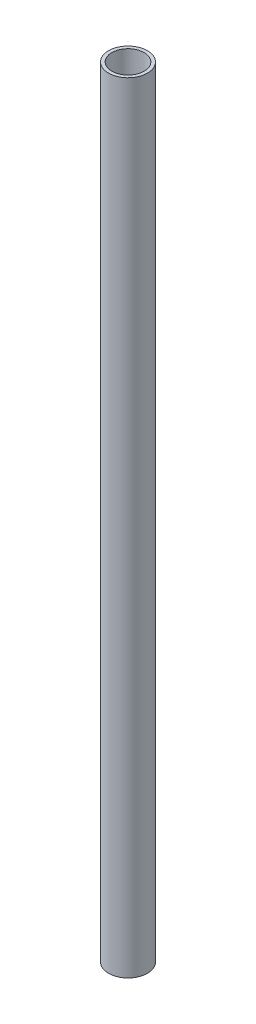
ISO-10303-21;
HEADER;
FILE_DESCRIPTION(('STEP AP214'),'2;1');
FILE_NAME('part.step','',(''),(''),'','','');
FILE_SCHEMA(('AUTOMOTIVE_DESIGN { 1 0 10303 214 1 1 1 1 }'));
ENDSEC;
DATA;
#1=APPLICATION_CONTEXT('core data for automotive mechanical design processes');
#2=APPLICATION_PROTOCOL_DEFINITION('international standard','automotive_design',2000,#1);
#3=PRODUCT_CONTEXT('',#1,'mechanical');
#4=PRODUCT('Part','Part','',(#3));
#5=PRODUCT_RELATED_PRODUCT_CATEGORY('part','',(#4));
#6=PRODUCT_DEFINITION_FORMATION('','',#4);
#7=PRODUCT_DEFINITION_CONTEXT('part definition',#1,'design');
#8=PRODUCT_DEFINITION('design','',#6,#7);
#9=PRODUCT_DEFINITION_SHAPE('','',#8);
#10=(LENGTH_UNIT() NAMED_UNIT(*) SI_UNIT(.MILLI.,.METRE.));
#11=(NAMED_UNIT(*) PLANE_ANGLE_UNIT() SI_UNIT($,.RADIAN.));
#12=(NAMED_UNIT(*) SI_UNIT($,.STERADIAN.) SOLID_ANGLE_UNIT());
#13=UNCERTAINTY_MEASURE_WITH_UNIT(LENGTH_MEASURE(1.E-05),#10,'distance_accuracy_value','');
#14=(GEOMETRIC_REPRESENTATION_CONTEXT(3) GLOBAL_UNCERTAINTY_ASSIGNED_CONTEXT((#13)) GLOBAL_UNIT_ASSIGNED_CONTEXT((#10,
#11,#12)) REPRESENTATION_CONTEXT('',''));
#15=CARTESIAN_POINT('',(0.,0.,0.));
#16=DIRECTION('',(0.,0.,1.));
#17=DIRECTION('',(1.,0.,0.));
#18=AXIS2_PLACEMENT_3D('',#15,#16,#17);
#19=CARTESIAN_POINT('',(0.,844.55,0.));
#20=DIRECTION('',(0.,1.,0.));
#21=DIRECTION('',(0.,0.,1.));
#22=AXIS2_PLACEMENT_3D('',#19,#20,#21);
#23=PLANE('',#22);
#24=CARTESIAN_POINT('',(0.,844.55,0.));
#25=DIRECTION('',(0.,1.,0.));
#26=DIRECTION('',(0.,0.,1.));
#27=AXIS2_PLACEMENT_3D('',#24,#25,#26);
#28=CIRCLE('',#27,21.082);
#29=CARTESIAN_POINT('',(0.,844.55,21.082));
#30=VERTEX_POINT('',#29);
#31=EDGE_CURVE('E10',#30,#30,#28,.T.);
#32=ORIENTED_EDGE('',*,*,#31,.T.);
#33=EDGE_LOOP('',(#32));
#34=FACE_BOUND('',#33,.T.);
#35=CARTESIAN_POINT('',(0.,844.55,0.));
#36=DIRECTION('',(0.,1.,0.));
#37=DIRECTION('',(0.,0.,1.));
#38=AXIS2_PLACEMENT_3D('',#35,#36,#37);
#39=CIRCLE('',#38,17.526);
#40=CARTESIAN_POINT('',(0.,844.55,17.526));
#41=VERTEX_POINT('',#40);
#42=EDGE_CURVE('E41',#41,#41,#39,.T.);
#43=ORIENTED_EDGE('',*,*,#42,.F.);
#44=EDGE_LOOP('',(#43));
#45=FACE_BOUND('',#44,.T.);
#46=ADVANCED_FACE('F30',(#34,#45),#23,.T.);
#47=CARTESIAN_POINT('',(0.,0.,0.));
#48=DIRECTION('',(0.,1.,0.));
#49=DIRECTION('',(0.,0.,1.));
#50=AXIS2_PLACEMENT_3D('',#47,#48,#49);
#51=PLANE('',#50);
#52=CARTESIAN_POINT('',(0.,0.,0.));
#53=DIRECTION('',(0.,1.,0.));
#54=DIRECTION('',(0.,0.,1.));
#55=AXIS2_PLACEMENT_3D('',#52,#53,#54);
#56=CIRCLE('',#55,21.082);
#57=CARTESIAN_POINT('',(0.,0.,21.082));
#58=VERTEX_POINT('',#57);
#59=EDGE_CURVE('E34',#58,#58,#56,.T.);
#60=ORIENTED_EDGE('',*,*,#59,.F.);
#61=EDGE_LOOP('',(#60));
#62=FACE_BOUND('',#61,.T.);
#63=CARTESIAN_POINT('',(0.,0.,0.));
#64=DIRECTION('',(0.,1.,0.));
#65=DIRECTION('',(0.,0.,1.));
#66=AXIS2_PLACEMENT_3D('',#63,#64,#65);
#67=CIRCLE('',#66,17.526);
#68=CARTESIAN_POINT('',(0.,0.,17.526));
#69=VERTEX_POINT('',#68);
#70=EDGE_CURVE('E43',#69,#69,#67,.T.);
#71=ORIENTED_EDGE('',*,*,#70,.T.);
#72=EDGE_LOOP('',(#71));
#73=FACE_BOUND('',#72,.T.);
#74=ADVANCED_FACE('F53',(#62,#73),#51,.F.);
#75=CARTESIAN_POINT('',(0.,844.55,0.));
#76=DIRECTION('',(0.,-1.,0.));
#77=DIRECTION('',(0.,0.,-1.));
#78=AXIS2_PLACEMENT_3D('',#75,#76,#77);
#79=CYLINDRICAL_SURFACE('',#78,21.082);
#80=ORIENTED_EDGE('',*,*,#31,.F.);
#81=EDGE_LOOP('',(#80));
#82=FACE_BOUND('',#81,.T.);
#83=ORIENTED_EDGE('',*,*,#59,.T.);
#84=EDGE_LOOP('',(#83));
#85=FACE_BOUND('',#84,.T.);
#86=ADVANCED_FACE('F32',(#82,#85),#79,.T.);
#87=CARTESIAN_POINT('',(0.,844.55,0.));
#88=DIRECTION('',(0.,-1.,0.));
#89=DIRECTION('',(0.,0.,-1.));
#90=AXIS2_PLACEMENT_3D('',#87,#88,#89);
#91=CYLINDRICAL_SURFACE('',#90,17.526);
#92=ORIENTED_EDGE('',*,*,#42,.T.);
#93=EDGE_LOOP('',(#92));
#94=FACE_BOUND('',#93,.T.);
#95=ORIENTED_EDGE('',*,*,#70,.F.);
#96=EDGE_LOOP('',(#95));
#97=FACE_BOUND('',#96,.T.);
#98=ADVANCED_FACE('F49',(#94,#97),#91,.F.);
#99=CLOSED_SHELL('',(#46,#74,#86,#98));
#100=MANIFOLD_SOLID_BREP('B2',#99);
#101=ADVANCED_BREP_SHAPE_REPRESENTATION('',(#18,#100),#14);
#102=SHAPE_DEFINITION_REPRESENTATION(#9,#101);
ENDSEC;
END-ISO-10303-21;
